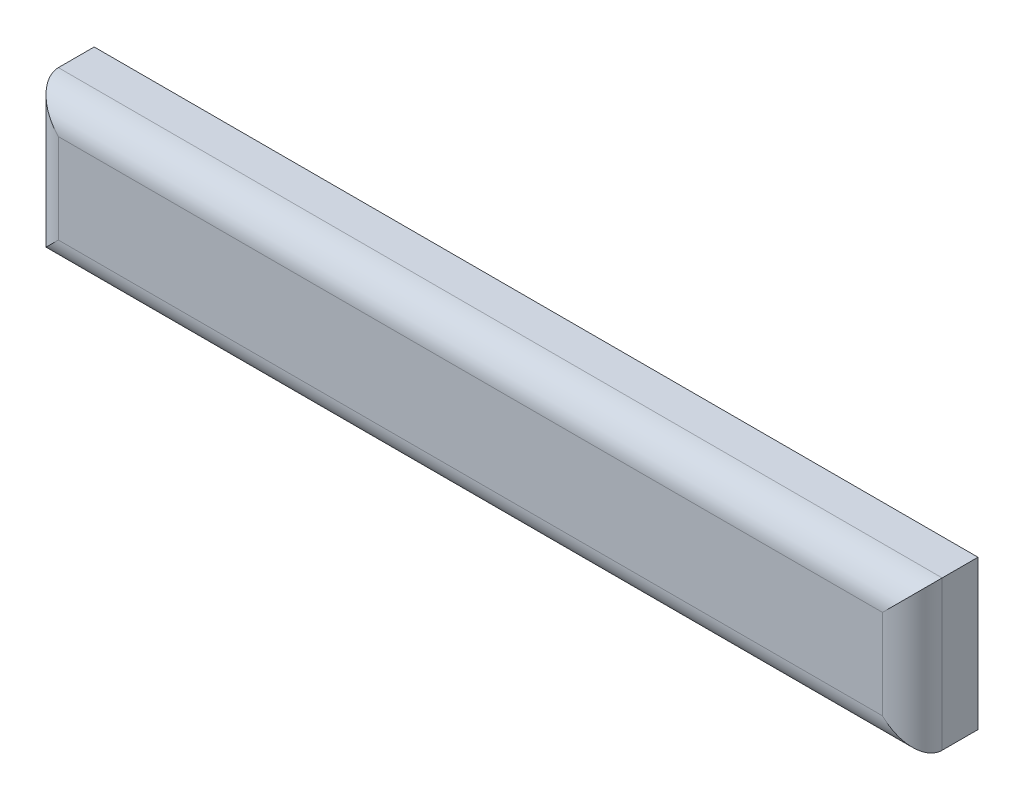
ISO-10303-21;
HEADER;
FILE_DESCRIPTION(('STEP AP214'),'2;1');
FILE_NAME('part.step','',(''),(''),'','','');
FILE_SCHEMA(('AUTOMOTIVE_DESIGN { 1 0 10303 214 1 1 1 1 }'));
ENDSEC;
DATA;
#1=APPLICATION_CONTEXT('core data for automotive mechanical design processes');
#2=APPLICATION_PROTOCOL_DEFINITION('international standard','automotive_design',2000,#1);
#3=PRODUCT_CONTEXT('',#1,'mechanical');
#4=PRODUCT('Part','Part','',(#3));
#5=PRODUCT_RELATED_PRODUCT_CATEGORY('part','',(#4));
#6=PRODUCT_DEFINITION_FORMATION('','',#4);
#7=PRODUCT_DEFINITION_CONTEXT('part definition',#1,'design');
#8=PRODUCT_DEFINITION('design','',#6,#7);
#9=PRODUCT_DEFINITION_SHAPE('','',#8);
#10=(LENGTH_UNIT() NAMED_UNIT(*) SI_UNIT(.MILLI.,.METRE.));
#11=(NAMED_UNIT(*) PLANE_ANGLE_UNIT() SI_UNIT($,.RADIAN.));
#12=(NAMED_UNIT(*) SI_UNIT($,.STERADIAN.) SOLID_ANGLE_UNIT());
#13=UNCERTAINTY_MEASURE_WITH_UNIT(LENGTH_MEASURE(1.E-05),#10,'distance_accuracy_value','');
#14=(GEOMETRIC_REPRESENTATION_CONTEXT(3) GLOBAL_UNCERTAINTY_ASSIGNED_CONTEXT((#13)) GLOBAL_UNIT_ASSIGNED_CONTEXT((#10,
#11,#12)) REPRESENTATION_CONTEXT('',''));
#15=CARTESIAN_POINT('',(0.,0.,0.));
#16=DIRECTION('',(0.,0.,1.));
#17=DIRECTION('',(1.,0.,0.));
#18=AXIS2_PLACEMENT_3D('',#15,#16,#17);
#19=CARTESIAN_POINT('',(-35.25,-22.5,11.));
#20=DIRECTION('',(1.,0.,0.));
#21=DIRECTION('',(0.,0.,-1.));
#22=AXIS2_PLACEMENT_3D('',#19,#20,#21);
#23=PLANE('',#22);
#24=DIRECTION('',(0.,0.,-1.));
#25=VECTOR('',#24,1.);
#26=CARTESIAN_POINT('',(-35.25,-47.5,11.));
#27=LINE('',#26,#25);
#28=CARTESIAN_POINT('',(-35.25,-47.5,6.));
#29=VERTEX_POINT('',#28);
#30=CARTESIAN_POINT('',(-35.25,-47.5,0.));
#31=VERTEX_POINT('',#30);
#32=EDGE_CURVE('E87',#29,#31,#27,.T.);
#33=ORIENTED_EDGE('',*,*,#32,.F.);
#34=DIRECTION('',(0.,-1.,0.));
#35=VECTOR('',#34,1.);
#36=CARTESIAN_POINT('',(-35.25,-22.5,6.));
#37=LINE('',#36,#35);
#38=CARTESIAN_POINT('',(-35.25,-22.5,6.));
#39=VERTEX_POINT('',#38);
#40=EDGE_CURVE('E134',#29,#39,#37,.F.);
#41=ORIENTED_EDGE('',*,*,#40,.T.);
#42=DIRECTION('',(0.,0.,-1.));
#43=VECTOR('',#42,1.);
#44=CARTESIAN_POINT('',(-35.25,-22.5,11.));
#45=LINE('',#44,#43);
#46=CARTESIAN_POINT('',(-35.25,-22.5,0.));
#47=VERTEX_POINT('',#46);
#48=EDGE_CURVE('E108',#39,#47,#45,.T.);
#49=ORIENTED_EDGE('',*,*,#48,.T.);
#50=DIRECTION('',(0.,-1.,0.));
#51=VECTOR('',#50,1.);
#52=CARTESIAN_POINT('',(-35.25,-22.5,0.));
#53=LINE('',#52,#51);
#54=EDGE_CURVE('E104',#47,#31,#53,.T.);
#55=ORIENTED_EDGE('',*,*,#54,.T.);
#56=EDGE_LOOP('',(#33,#41,#49,#55));
#57=FACE_BOUND('',#56,.T.);
#58=ADVANCED_FACE('F33',(#57),#23,.F.);
#59=CARTESIAN_POINT('',(112.75,-47.5,11.));
#60=DIRECTION('',(0.,1.,0.));
#61=DIRECTION('',(-1.,0.,0.));
#62=AXIS2_PLACEMENT_3D('',#59,#60,#61);
#63=PLANE('',#62);
#64=DIRECTION('',(0.,0.,-1.));
#65=VECTOR('',#64,1.);
#66=CARTESIAN_POINT('',(112.75,-47.5,11.));
#67=LINE('',#66,#65);
#68=CARTESIAN_POINT('',(112.75,-47.5,6.));
#69=VERTEX_POINT('',#68);
#70=CARTESIAN_POINT('',(112.75,-47.5,0.));
#71=VERTEX_POINT('',#70);
#72=EDGE_CURVE('E98',#69,#71,#67,.T.);
#73=ORIENTED_EDGE('',*,*,#72,.F.);
#74=DIRECTION('',(1.,0.,0.));
#75=VECTOR('',#74,1.);
#76=CARTESIAN_POINT('',(112.75,-47.5,6.));
#77=LINE('',#76,#75);
#78=EDGE_CURVE('E11',#69,#29,#77,.F.);
#79=ORIENTED_EDGE('',*,*,#78,.T.);
#80=ORIENTED_EDGE('',*,*,#32,.T.);
#81=DIRECTION('',(1.,0.,0.));
#82=VECTOR('',#81,1.);
#83=CARTESIAN_POINT('',(112.75,-47.5,0.));
#84=LINE('',#83,#82);
#85=EDGE_CURVE('E90',#31,#71,#84,.T.);
#86=ORIENTED_EDGE('',*,*,#85,.T.);
#87=EDGE_LOOP('',(#73,#79,#80,#86));
#88=FACE_BOUND('',#87,.T.);
#89=ADVANCED_FACE('F89',(#88),#63,.F.);
#90=CARTESIAN_POINT('',(112.75,-22.5,11.));
#91=DIRECTION('',(-1.,0.,0.));
#92=DIRECTION('',(0.,0.,1.));
#93=AXIS2_PLACEMENT_3D('',#90,#91,#92);
#94=PLANE('',#93);
#95=DIRECTION('',(0.,0.,-1.));
#96=VECTOR('',#95,1.);
#97=CARTESIAN_POINT('',(112.75,-22.5,11.));
#98=LINE('',#97,#96);
#99=CARTESIAN_POINT('',(112.75,-22.5,6.));
#100=VERTEX_POINT('',#99);
#101=CARTESIAN_POINT('',(112.75,-22.5,0.));
#102=VERTEX_POINT('',#101);
#103=EDGE_CURVE('E123',#100,#102,#98,.T.);
#104=ORIENTED_EDGE('',*,*,#103,.F.);
#105=DIRECTION('',(0.,1.,0.));
#106=VECTOR('',#105,1.);
#107=CARTESIAN_POINT('',(112.75,-22.5,6.));
#108=LINE('',#107,#106);
#109=EDGE_CURVE('E42',#100,#69,#108,.F.);
#110=ORIENTED_EDGE('',*,*,#109,.T.);
#111=ORIENTED_EDGE('',*,*,#72,.T.);
#112=DIRECTION('',(0.,1.,0.));
#113=VECTOR('',#112,1.);
#114=CARTESIAN_POINT('',(112.75,-22.5,0.));
#115=LINE('',#114,#113);
#116=EDGE_CURVE('E106',#71,#102,#115,.T.);
#117=ORIENTED_EDGE('',*,*,#116,.T.);
#118=EDGE_LOOP('',(#104,#110,#111,#117));
#119=FACE_BOUND('',#118,.T.);
#120=ADVANCED_FACE('F186',(#119),#94,.F.);
#121=CARTESIAN_POINT('',(112.75,-22.5,11.));
#122=DIRECTION('',(0.,-1.,0.));
#123=DIRECTION('',(1.,0.,0.));
#124=AXIS2_PLACEMENT_3D('',#121,#122,#123);
#125=PLANE('',#124);
#126=ORIENTED_EDGE('',*,*,#48,.F.);
#127=DIRECTION('',(-1.,0.,0.));
#128=VECTOR('',#127,1.);
#129=CARTESIAN_POINT('',(112.75,-22.5,6.));
#130=LINE('',#129,#128);
#131=EDGE_CURVE('E57',#39,#100,#130,.F.);
#132=ORIENTED_EDGE('',*,*,#131,.T.);
#133=ORIENTED_EDGE('',*,*,#103,.T.);
#134=DIRECTION('',(-1.,0.,0.));
#135=VECTOR('',#134,1.);
#136=CARTESIAN_POINT('',(112.75,-22.5,0.));
#137=LINE('',#136,#135);
#138=EDGE_CURVE('E120',#102,#47,#137,.T.);
#139=ORIENTED_EDGE('',*,*,#138,.T.);
#140=EDGE_LOOP('',(#126,#132,#133,#139));
#141=FACE_BOUND('',#140,.T.);
#142=ADVANCED_FACE('F213',(#141),#125,.F.);
#143=CARTESIAN_POINT('',(0.,0.,11.));
#144=DIRECTION('',(0.,0.,-1.));
#145=DIRECTION('',(-1.,0.,0.));
#146=AXIS2_PLACEMENT_3D('',#143,#144,#145);
#147=PLANE('',#146);
#148=DIRECTION('',(-1.,0.,0.));
#149=VECTOR('',#148,1.);
#150=CARTESIAN_POINT('',(0.,-27.5,11.));
#151=LINE('',#150,#149);
#152=CARTESIAN_POINT('',(107.75,-27.5,11.));
#153=VERTEX_POINT('',#152);
#154=CARTESIAN_POINT('',(-30.25,-27.5,11.));
#155=VERTEX_POINT('',#154);
#156=EDGE_CURVE('E129',#153,#155,#151,.T.);
#157=ORIENTED_EDGE('',*,*,#156,.T.);
#158=DIRECTION('',(0.,-1.,0.));
#159=VECTOR('',#158,1.);
#160=CARTESIAN_POINT('',(-30.25,0.,11.));
#161=LINE('',#160,#159);
#162=CARTESIAN_POINT('',(-30.25,-42.5,11.));
#163=VERTEX_POINT('',#162);
#164=EDGE_CURVE('E131',#155,#163,#161,.T.);
#165=ORIENTED_EDGE('',*,*,#164,.T.);
#166=DIRECTION('',(1.,0.,0.));
#167=VECTOR('',#166,1.);
#168=CARTESIAN_POINT('',(0.,-42.5,11.));
#169=LINE('',#168,#167);
#170=CARTESIAN_POINT('',(107.75,-42.5,11.));
#171=VERTEX_POINT('',#170);
#172=EDGE_CURVE('E97',#163,#171,#169,.T.);
#173=ORIENTED_EDGE('',*,*,#172,.T.);
#174=DIRECTION('',(0.,1.,0.));
#175=VECTOR('',#174,1.);
#176=CARTESIAN_POINT('',(107.75,0.,11.));
#177=LINE('',#176,#175);
#178=EDGE_CURVE('E127',#171,#153,#177,.T.);
#179=ORIENTED_EDGE('',*,*,#178,.T.);
#180=EDGE_LOOP('',(#157,#165,#173,#179));
#181=FACE_BOUND('',#180,.T.);
#182=ADVANCED_FACE('F218',(#181),#147,.F.);
#183=CARTESIAN_POINT('',(0.,0.,0.));
#184=DIRECTION('',(0.,0.,-1.));
#185=DIRECTION('',(-1.,0.,0.));
#186=AXIS2_PLACEMENT_3D('',#183,#184,#185);
#187=PLANE('',#186);
#188=CARTESIAN_POINT('',(73.75,-35.,0.));
#189=DIRECTION('',(0.,0.,-1.));
#190=DIRECTION('',(-1.,0.,0.));
#191=AXIS2_PLACEMENT_3D('',#188,#189,#190);
#192=CIRCLE('',#191,7.);
#193=CARTESIAN_POINT('',(66.75,-35.,0.));
#194=VERTEX_POINT('',#193);
#195=EDGE_CURVE('E151',#194,#194,#192,.T.);
#196=ORIENTED_EDGE('',*,*,#195,.F.);
#197=EDGE_LOOP('',(#196));
#198=FACE_BOUND('',#197,.T.);
#199=CARTESIAN_POINT('',(3.74999999999996,-35.,0.));
#200=DIRECTION('',(0.,0.,-1.));
#201=DIRECTION('',(1.,0.,0.));
#202=AXIS2_PLACEMENT_3D('',#199,#200,#201);
#203=CIRCLE('',#202,7.);
#204=CARTESIAN_POINT('',(10.75,-35.,0.));
#205=VERTEX_POINT('',#204);
#206=EDGE_CURVE('E161',#205,#205,#203,.T.);
#207=ORIENTED_EDGE('',*,*,#206,.F.);
#208=EDGE_LOOP('',(#207));
#209=FACE_BOUND('',#208,.T.);
#210=ORIENTED_EDGE('',*,*,#54,.F.);
#211=ORIENTED_EDGE('',*,*,#138,.F.);
#212=ORIENTED_EDGE('',*,*,#116,.F.);
#213=ORIENTED_EDGE('',*,*,#85,.F.);
#214=EDGE_LOOP('',(#210,#211,#212,#213));
#215=FACE_BOUND('',#214,.T.);
#216=ADVANCED_FACE('F102',(#198,#209,#215),#187,.T.);
#217=CARTESIAN_POINT('',(107.75,0.,6.));
#218=DIRECTION('',(0.,1.,0.));
#219=DIRECTION('',(0.,0.,1.));
#220=AXIS2_PLACEMENT_3D('',#217,#218,#219);
#221=CYLINDRICAL_SURFACE('',#220,5.);
#222=CARTESIAN_POINT('',(107.75,-42.5,6.));
#223=DIRECTION('',(0.707106781186547,0.707106781186548,0.));
#224=DIRECTION('',(0.707106781186548,-0.707106781186547,0.));
#225=AXIS2_PLACEMENT_3D('',#222,#223,#224);
#226=ELLIPSE('',#225,7.07106781186547,5.);
#227=EDGE_CURVE('E113',#69,#171,#226,.F.);
#228=ORIENTED_EDGE('',*,*,#227,.F.);
#229=ORIENTED_EDGE('',*,*,#109,.F.);
#230=CARTESIAN_POINT('',(107.75,-27.5,6.));
#231=DIRECTION('',(-0.707106781186548,0.707106781186547,0.));
#232=DIRECTION('',(0.707106781186547,0.707106781186548,0.));
#233=AXIS2_PLACEMENT_3D('',#230,#231,#232);
#234=ELLIPSE('',#233,7.07106781186548,5.);
#235=EDGE_CURVE('E110',#153,#100,#234,.T.);
#236=ORIENTED_EDGE('',*,*,#235,.F.);
#237=ORIENTED_EDGE('',*,*,#178,.F.);
#238=EDGE_LOOP('',(#228,#229,#236,#237));
#239=FACE_BOUND('',#238,.T.);
#240=ADVANCED_FACE('F35',(#239),#221,.T.);
#241=CARTESIAN_POINT('',(0.,-27.5,6.));
#242=DIRECTION('',(-1.,0.,0.));
#243=DIRECTION('',(0.,-1.,0.));
#244=AXIS2_PLACEMENT_3D('',#241,#242,#243);
#245=CYLINDRICAL_SURFACE('',#244,5.);
#246=ORIENTED_EDGE('',*,*,#235,.T.);
#247=ORIENTED_EDGE('',*,*,#131,.F.);
#248=CARTESIAN_POINT('',(-30.25,-27.5,6.));
#249=DIRECTION('',(-0.707106781186547,-0.707106781186548,0.));
#250=DIRECTION('',(-0.707106781186548,0.707106781186547,0.));
#251=AXIS2_PLACEMENT_3D('',#248,#249,#250);
#252=ELLIPSE('',#251,7.07106781186547,5.);
#253=EDGE_CURVE('E140',#155,#39,#252,.T.);
#254=ORIENTED_EDGE('',*,*,#253,.F.);
#255=ORIENTED_EDGE('',*,*,#156,.F.);
#256=EDGE_LOOP('',(#246,#247,#254,#255));
#257=FACE_BOUND('',#256,.T.);
#258=ADVANCED_FACE('F197',(#257),#245,.T.);
#259=CARTESIAN_POINT('',(0.,-42.5,6.));
#260=DIRECTION('',(1.,0.,0.));
#261=DIRECTION('',(0.,1.,0.));
#262=AXIS2_PLACEMENT_3D('',#259,#260,#261);
#263=CYLINDRICAL_SURFACE('',#262,5.);
#264=ORIENTED_EDGE('',*,*,#227,.T.);
#265=ORIENTED_EDGE('',*,*,#172,.F.);
#266=CARTESIAN_POINT('',(-30.25,-42.5,6.));
#267=DIRECTION('',(0.707106781186548,-0.707106781186547,0.));
#268=DIRECTION('',(0.707106781186547,0.707106781186548,0.));
#269=AXIS2_PLACEMENT_3D('',#266,#267,#268);
#270=ELLIPSE('',#269,7.07106781186548,5.);
#271=EDGE_CURVE('E138',#29,#163,#270,.F.);
#272=ORIENTED_EDGE('',*,*,#271,.F.);
#273=ORIENTED_EDGE('',*,*,#78,.F.);
#274=EDGE_LOOP('',(#264,#265,#272,#273));
#275=FACE_BOUND('',#274,.T.);
#276=ADVANCED_FACE('F194',(#275),#263,.T.);
#277=CARTESIAN_POINT('',(-30.25,0.,6.));
#278=DIRECTION('',(0.,-1.,0.));
#279=DIRECTION('',(0.,0.,-1.));
#280=AXIS2_PLACEMENT_3D('',#277,#278,#279);
#281=CYLINDRICAL_SURFACE('',#280,5.);
#282=ORIENTED_EDGE('',*,*,#253,.T.);
#283=ORIENTED_EDGE('',*,*,#40,.F.);
#284=ORIENTED_EDGE('',*,*,#271,.T.);
#285=ORIENTED_EDGE('',*,*,#164,.F.);
#286=EDGE_LOOP('',(#282,#283,#284,#285));
#287=FACE_BOUND('',#286,.T.);
#288=ADVANCED_FACE('F190',(#287),#281,.T.);
#289=CARTESIAN_POINT('',(73.75,-35.,4.5));
#290=DIRECTION('',(0.,0.,-1.));
#291=DIRECTION('',(-1.,0.,0.));
#292=AXIS2_PLACEMENT_3D('',#289,#290,#291);
#293=PLANE('',#292);
#294=CARTESIAN_POINT('',(73.75,-35.,4.5));
#295=DIRECTION('',(0.,0.,-1.));
#296=DIRECTION('',(-1.,0.,0.));
#297=AXIS2_PLACEMENT_3D('',#294,#295,#296);
#298=CIRCLE('',#297,7.);
#299=CARTESIAN_POINT('',(66.75,-35.,4.5));
#300=VERTEX_POINT('',#299);
#301=EDGE_CURVE('E146',#300,#300,#298,.T.);
#302=ORIENTED_EDGE('',*,*,#301,.T.);
#303=EDGE_LOOP('',(#302));
#304=FACE_BOUND('',#303,.T.);
#305=CARTESIAN_POINT('',(73.75,-35.,4.5));
#306=DIRECTION('',(0.,0.,-1.));
#307=DIRECTION('',(-1.,0.,0.));
#308=AXIS2_PLACEMENT_3D('',#305,#306,#307);
#309=CIRCLE('',#308,5.87500000000001);
#310=CARTESIAN_POINT('',(67.875,-35.,4.5));
#311=VERTEX_POINT('',#310);
#312=EDGE_CURVE('E144',#311,#311,#309,.F.);
#313=ORIENTED_EDGE('',*,*,#312,.T.);
#314=EDGE_LOOP('',(#313));
#315=FACE_BOUND('',#314,.T.);
#316=ADVANCED_FACE('F193',(#304,#315),#293,.T.);
#317=CARTESIAN_POINT('',(73.75,-35.,4.5));
#318=DIRECTION('',(0.,0.,-1.));
#319=DIRECTION('',(-1.,0.,0.));
#320=AXIS2_PLACEMENT_3D('',#317,#318,#319);
#321=CYLINDRICAL_SURFACE('',#320,7.);
#322=ORIENTED_EDGE('',*,*,#301,.F.);
#323=EDGE_LOOP('',(#322));
#324=FACE_BOUND('',#323,.T.);
#325=ORIENTED_EDGE('',*,*,#195,.T.);
#326=EDGE_LOOP('',(#325));
#327=FACE_BOUND('',#326,.T.);
#328=ADVANCED_FACE('F304',(#324,#327),#321,.F.);
#329=CARTESIAN_POINT('',(3.74999999999996,-35.,4.5));
#330=DIRECTION('',(0.,0.,1.));
#331=DIRECTION('',(1.,0.,0.));
#332=AXIS2_PLACEMENT_3D('',#329,#330,#331);
#333=PLANE('',#332);
#334=CARTESIAN_POINT('',(3.74999999999996,-35.,4.5));
#335=DIRECTION('',(0.,0.,-1.));
#336=DIRECTION('',(1.,0.,0.));
#337=AXIS2_PLACEMENT_3D('',#334,#335,#336);
#338=CIRCLE('',#337,7.);
#339=CARTESIAN_POINT('',(10.75,-35.,4.5));
#340=VERTEX_POINT('',#339);
#341=EDGE_CURVE('E156',#340,#340,#338,.T.);
#342=ORIENTED_EDGE('',*,*,#341,.T.);
#343=EDGE_LOOP('',(#342));
#344=FACE_BOUND('',#343,.T.);
#345=CARTESIAN_POINT('',(3.74999999999996,-35.,4.5));
#346=DIRECTION('',(0.,0.,1.));
#347=DIRECTION('',(1.,0.,0.));
#348=AXIS2_PLACEMENT_3D('',#345,#346,#347);
#349=CIRCLE('',#348,5.87500000000001);
#350=CARTESIAN_POINT('',(9.62499999999997,-35.,4.5));
#351=VERTEX_POINT('',#350);
#352=EDGE_CURVE('E37',#351,#351,#349,.F.);
#353=ORIENTED_EDGE('',*,*,#352,.F.);
#354=EDGE_LOOP('',(#353));
#355=FACE_BOUND('',#354,.T.);
#356=ADVANCED_FACE('F296',(#344,#355),#333,.F.);
#357=CARTESIAN_POINT('',(3.74999999999996,-35.,4.5));
#358=DIRECTION('',(0.,0.,-1.));
#359=DIRECTION('',(-1.,0.,0.));
#360=AXIS2_PLACEMENT_3D('',#357,#358,#359);
#361=CYLINDRICAL_SURFACE('',#360,7.);
#362=ORIENTED_EDGE('',*,*,#341,.F.);
#363=EDGE_LOOP('',(#362));
#364=FACE_BOUND('',#363,.T.);
#365=ORIENTED_EDGE('',*,*,#206,.T.);
#366=EDGE_LOOP('',(#365));
#367=FACE_BOUND('',#366,.T.);
#368=ADVANCED_FACE('F272',(#364,#367),#361,.F.);
#369=CARTESIAN_POINT('',(73.75,-35.,9.));
#370=DIRECTION('',(0.,0.,-1.));
#371=DIRECTION('',(-1.,0.,0.));
#372=AXIS2_PLACEMENT_3D('',#369,#370,#371);
#373=PLANE('',#372);
#374=CARTESIAN_POINT('',(73.75,-35.,9.));
#375=DIRECTION('',(0.,0.,-1.));
#376=DIRECTION('',(-1.,0.,0.));
#377=AXIS2_PLACEMENT_3D('',#374,#375,#376);
#378=CIRCLE('',#377,5.87500000000001);
#379=CARTESIAN_POINT('',(67.875,-35.,9.));
#380=VERTEX_POINT('',#379);
#381=EDGE_CURVE('E141',#380,#380,#378,.T.);
#382=ORIENTED_EDGE('',*,*,#381,.T.);
#383=EDGE_LOOP('',(#382));
#384=FACE_BOUND('',#383,.T.);
#385=ADVANCED_FACE('F269',(#384),#373,.T.);
#386=CARTESIAN_POINT('',(73.75,-35.,9.));
#387=DIRECTION('',(0.,0.,-1.));
#388=DIRECTION('',(-1.,0.,0.));
#389=AXIS2_PLACEMENT_3D('',#386,#387,#388);
#390=CYLINDRICAL_SURFACE('',#389,5.87500000000001);
#391=ORIENTED_EDGE('',*,*,#381,.F.);
#392=EDGE_LOOP('',(#391));
#393=FACE_BOUND('',#392,.T.);
#394=ORIENTED_EDGE('',*,*,#312,.F.);
#395=EDGE_LOOP('',(#394));
#396=FACE_BOUND('',#395,.T.);
#397=ADVANCED_FACE('F178',(#393,#396),#390,.F.);
#398=CARTESIAN_POINT('',(3.74999999999996,-35.,9.));
#399=DIRECTION('',(0.,0.,1.));
#400=DIRECTION('',(1.,0.,0.));
#401=AXIS2_PLACEMENT_3D('',#398,#399,#400);
#402=PLANE('',#401);
#403=CARTESIAN_POINT('',(3.74999999999996,-35.,9.));
#404=DIRECTION('',(0.,0.,-1.));
#405=DIRECTION('',(1.,0.,0.));
#406=AXIS2_PLACEMENT_3D('',#403,#404,#405);
#407=CIRCLE('',#406,5.87500000000001);
#408=CARTESIAN_POINT('',(9.62499999999997,-35.,9.));
#409=VERTEX_POINT('',#408);
#410=EDGE_CURVE('E116',#409,#409,#407,.T.);
#411=ORIENTED_EDGE('',*,*,#410,.T.);
#412=EDGE_LOOP('',(#411));
#413=FACE_BOUND('',#412,.T.);
#414=ADVANCED_FACE('F169',(#413),#402,.F.);
#415=CARTESIAN_POINT('',(3.74999999999996,-35.,9.));
#416=DIRECTION('',(0.,0.,-1.));
#417=DIRECTION('',(-1.,0.,0.));
#418=AXIS2_PLACEMENT_3D('',#415,#416,#417);
#419=CYLINDRICAL_SURFACE('',#418,5.87500000000001);
#420=ORIENTED_EDGE('',*,*,#352,.T.);
#421=EDGE_LOOP('',(#420));
#422=FACE_BOUND('',#421,.T.);
#423=ORIENTED_EDGE('',*,*,#410,.F.);
#424=EDGE_LOOP('',(#423));
#425=FACE_BOUND('',#424,.T.);
#426=ADVANCED_FACE('F171',(#422,#425),#419,.F.);
#427=CLOSED_SHELL('',(#58,#89,#120,#142,#182,#216,#240,#258,#276,#288,#316,#328,#356,#368,#385,
#397,#414,#426));
#428=MANIFOLD_SOLID_BREP('B2',#427);
#429=ADVANCED_BREP_SHAPE_REPRESENTATION('',(#18,#428),#14);
#430=SHAPE_DEFINITION_REPRESENTATION(#9,#429);
ENDSEC;
END-ISO-10303-21;
